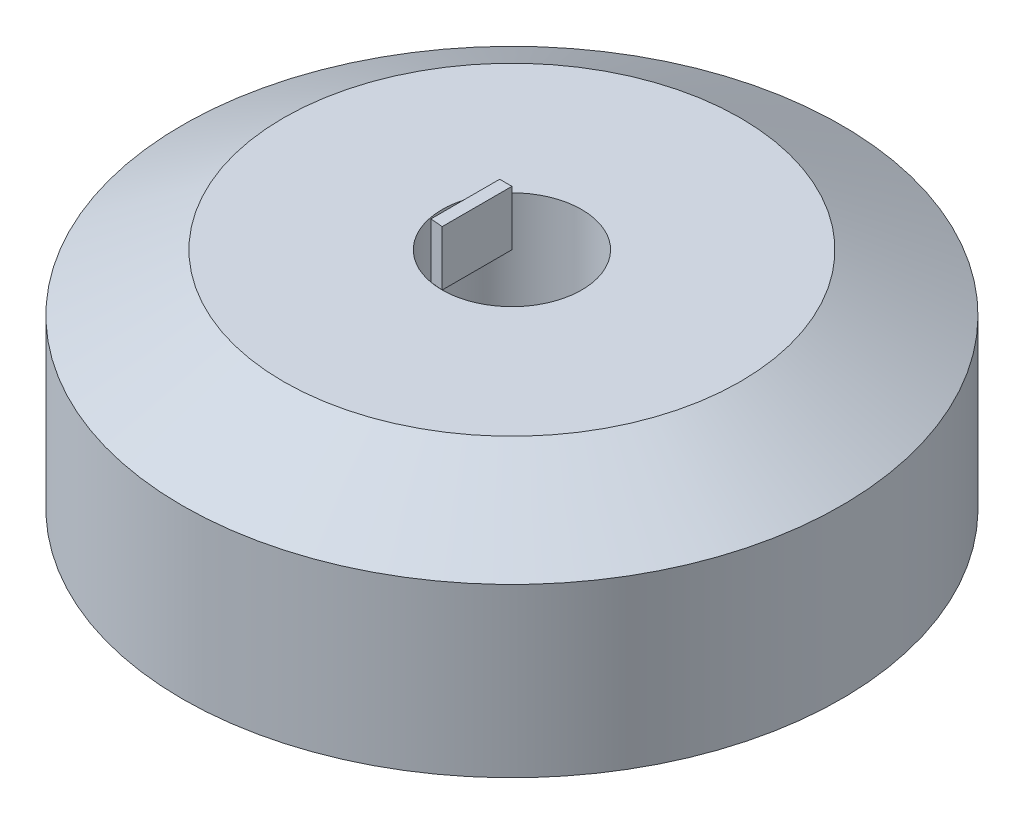
ISO-10303-21;
HEADER;
FILE_DESCRIPTION(('STEP AP214'),'2;1');
FILE_NAME('part.step','',(''),(''),'','','');
FILE_SCHEMA(('AUTOMOTIVE_DESIGN { 1 0 10303 214 1 1 1 1 }'));
ENDSEC;
DATA;
#1=APPLICATION_CONTEXT('core data for automotive mechanical design processes');
#2=APPLICATION_PROTOCOL_DEFINITION('international standard','automotive_design',2000,#1);
#3=PRODUCT_CONTEXT('',#1,'mechanical');
#4=PRODUCT('Part','Part','',(#3));
#5=PRODUCT_RELATED_PRODUCT_CATEGORY('part','',(#4));
#6=PRODUCT_DEFINITION_FORMATION('','',#4);
#7=PRODUCT_DEFINITION_CONTEXT('part definition',#1,'design');
#8=PRODUCT_DEFINITION('design','',#6,#7);
#9=PRODUCT_DEFINITION_SHAPE('','',#8);
#10=(LENGTH_UNIT() NAMED_UNIT(*) SI_UNIT(.MILLI.,.METRE.));
#11=(NAMED_UNIT(*) PLANE_ANGLE_UNIT() SI_UNIT($,.RADIAN.));
#12=(NAMED_UNIT(*) SI_UNIT($,.STERADIAN.) SOLID_ANGLE_UNIT());
#13=UNCERTAINTY_MEASURE_WITH_UNIT(LENGTH_MEASURE(1.E-05),#10,'distance_accuracy_value','');
#14=(GEOMETRIC_REPRESENTATION_CONTEXT(3) GLOBAL_UNCERTAINTY_ASSIGNED_CONTEXT((#13)) GLOBAL_UNIT_ASSIGNED_CONTEXT((#10,
#11,#12)) REPRESENTATION_CONTEXT('',''));
#15=CARTESIAN_POINT('',(0.,0.,0.));
#16=DIRECTION('',(0.,0.,1.));
#17=DIRECTION('',(1.,0.,0.));
#18=AXIS2_PLACEMENT_3D('',#15,#16,#17);
#19=CARTESIAN_POINT('',(0.,7.1181,2.54));
#20=DIRECTION('',(-1.,0.,0.));
#21=DIRECTION('',(0.,0.,1.));
#22=AXIS2_PLACEMENT_3D('',#19,#20,#21);
#23=PLANE('',#22);
#24=DIRECTION('',(0.,0.,-1.));
#25=VECTOR('',#24,1.);
#26=CARTESIAN_POINT('',(0.,5.1181,2.54));
#27=LINE('',#26,#25);
#28=CARTESIAN_POINT('',(0.,5.1181,2.54));
#29=VERTEX_POINT('',#28);
#30=CARTESIAN_POINT('',(0.,5.1181,0.));
#31=VERTEX_POINT('',#30);
#32=EDGE_CURVE('E104',#29,#31,#27,.T.);
#33=ORIENTED_EDGE('',*,*,#32,.T.);
#34=DIRECTION('',(0.,-1.,0.));
#35=VECTOR('',#34,1.);
#36=CARTESIAN_POINT('',(0.,7.1181,0.));
#37=LINE('',#36,#35);
#38=CARTESIAN_POINT('',(0.,7.1181,0.));
#39=VERTEX_POINT('',#38);
#40=EDGE_CURVE('E12',#39,#31,#37,.T.);
#41=ORIENTED_EDGE('',*,*,#40,.F.);
#42=DIRECTION('',(0.,0.,-1.));
#43=VECTOR('',#42,1.);
#44=CARTESIAN_POINT('',(0.,7.1181,2.54));
#45=LINE('',#44,#43);
#46=CARTESIAN_POINT('',(0.,7.1181,2.54));
#47=VERTEX_POINT('',#46);
#48=EDGE_CURVE('E92',#47,#39,#45,.T.);
#49=ORIENTED_EDGE('',*,*,#48,.F.);
#50=DIRECTION('',(0.,-1.,0.));
#51=VECTOR('',#50,1.);
#52=CARTESIAN_POINT('',(0.,7.1181,2.54));
#53=LINE('',#52,#51);
#54=EDGE_CURVE('E100',#47,#29,#53,.T.);
#55=ORIENTED_EDGE('',*,*,#54,.T.);
#56=EDGE_LOOP('',(#33,#41,#49,#55));
#57=FACE_BOUND('',#56,.T.);
#58=ADVANCED_FACE('F41',(#57),#23,.F.);
#59=CARTESIAN_POINT('',(0.,7.1181,0.));
#60=DIRECTION('',(0.,0.,1.));
#61=DIRECTION('',(1.,0.,0.));
#62=AXIS2_PLACEMENT_3D('',#59,#60,#61);
#63=PLANE('',#62);
#64=DIRECTION('',(-1.,0.,0.));
#65=VECTOR('',#64,1.);
#66=CARTESIAN_POINT('',(0.,5.1181,0.));
#67=LINE('',#66,#65);
#68=CARTESIAN_POINT('',(-0.446980104726435,5.1181,0.));
#69=VERTEX_POINT('',#68);
#70=EDGE_CURVE('E96',#31,#69,#67,.T.);
#71=ORIENTED_EDGE('',*,*,#70,.T.);
#72=DIRECTION('',(0.,-1.,0.));
#73=VECTOR('',#72,1.);
#74=CARTESIAN_POINT('',(-0.446980104726435,7.1181,0.));
#75=LINE('',#74,#73);
#76=CARTESIAN_POINT('',(-0.446980104726435,7.1181,0.));
#77=VERTEX_POINT('',#76);
#78=EDGE_CURVE('E49',#77,#69,#75,.T.);
#79=ORIENTED_EDGE('',*,*,#78,.F.);
#80=DIRECTION('',(-1.,0.,0.));
#81=VECTOR('',#80,1.);
#82=CARTESIAN_POINT('',(0.,7.1181,0.));
#83=LINE('',#82,#81);
#84=EDGE_CURVE('E87',#39,#77,#83,.T.);
#85=ORIENTED_EDGE('',*,*,#84,.F.);
#86=ORIENTED_EDGE('',*,*,#40,.T.);
#87=EDGE_LOOP('',(#71,#79,#85,#86));
#88=FACE_BOUND('',#87,.T.);
#89=ADVANCED_FACE('F95',(#88),#63,.F.);
#90=CARTESIAN_POINT('',(-0.446980104726435,7.1181,0.));
#91=DIRECTION('',(1.,0.,0.));
#92=DIRECTION('',(0.,0.,-1.));
#93=AXIS2_PLACEMENT_3D('',#90,#91,#92);
#94=PLANE('',#93);
#95=DIRECTION('',(0.,0.,1.));
#96=VECTOR('',#95,1.);
#97=CARTESIAN_POINT('',(-0.446980104726435,5.1181,0.));
#98=LINE('',#97,#96);
#99=CARTESIAN_POINT('',(-0.446980104726435,5.1181,2.50036173102588));
#100=VERTEX_POINT('',#99);
#101=EDGE_CURVE('E74',#69,#100,#98,.T.);
#102=ORIENTED_EDGE('',*,*,#101,.T.);
#103=DIRECTION('',(0.,-1.,0.));
#104=VECTOR('',#103,1.);
#105=CARTESIAN_POINT('',(-0.446980104726435,7.1181,2.50036173102588));
#106=LINE('',#105,#104);
#107=CARTESIAN_POINT('',(-0.446980104726435,7.1181,2.50036173102588));
#108=VERTEX_POINT('',#107);
#109=EDGE_CURVE('E97',#108,#100,#106,.T.);
#110=ORIENTED_EDGE('',*,*,#109,.F.);
#111=DIRECTION('',(0.,0.,1.));
#112=VECTOR('',#111,1.);
#113=CARTESIAN_POINT('',(-0.446980104726435,7.1181,0.));
#114=LINE('',#113,#112);
#115=EDGE_CURVE('E90',#77,#108,#114,.T.);
#116=ORIENTED_EDGE('',*,*,#115,.F.);
#117=ORIENTED_EDGE('',*,*,#78,.T.);
#118=EDGE_LOOP('',(#102,#110,#116,#117));
#119=FACE_BOUND('',#118,.T.);
#120=ADVANCED_FACE('F98',(#119),#94,.F.);
#121=CARTESIAN_POINT('',(-0.446980104726435,7.1181,2.50036173102588));
#122=DIRECTION('',(0.0883335092316207,0.,-0.996090955258016));
#123=DIRECTION('',(-0.996090955258016,0.,-0.0883335092316207));
#124=AXIS2_PLACEMENT_3D('',#121,#122,#123);
#125=PLANE('',#124);
#126=DIRECTION('',(0.996090955258016,0.,0.0883335092316207));
#127=VECTOR('',#126,1.);
#128=CARTESIAN_POINT('',(-0.446980104726435,5.1181,2.50036173102588));
#129=LINE('',#128,#127);
#130=EDGE_CURVE('E80',#100,#29,#129,.T.);
#131=ORIENTED_EDGE('',*,*,#130,.T.);
#132=ORIENTED_EDGE('',*,*,#54,.F.);
#133=DIRECTION('',(0.996090955258016,0.,0.0883335092316207));
#134=VECTOR('',#133,1.);
#135=CARTESIAN_POINT('',(-0.446980104726435,7.1181,2.50036173102588));
#136=LINE('',#135,#134);
#137=EDGE_CURVE('E57',#108,#47,#136,.T.);
#138=ORIENTED_EDGE('',*,*,#137,.F.);
#139=ORIENTED_EDGE('',*,*,#109,.T.);
#140=EDGE_LOOP('',(#131,#132,#138,#139));
#141=FACE_BOUND('',#140,.T.);
#142=ADVANCED_FACE('F111',(#141),#125,.F.);
#143=CARTESIAN_POINT('',(0.,7.1181,0.));
#144=DIRECTION('',(0.,1.,0.));
#145=DIRECTION('',(0.,0.,1.));
#146=AXIS2_PLACEMENT_3D('',#143,#144,#145);
#147=PLANE('',#146);
#148=ORIENTED_EDGE('',*,*,#48,.T.);
#149=ORIENTED_EDGE('',*,*,#84,.T.);
#150=ORIENTED_EDGE('',*,*,#115,.T.);
#151=ORIENTED_EDGE('',*,*,#137,.T.);
#152=EDGE_LOOP('',(#148,#149,#150,#151));
#153=FACE_BOUND('',#152,.T.);
#154=ADVANCED_FACE('F88',(#153),#147,.T.);
#155=CARTESIAN_POINT('',(0.,5.1181,0.));
#156=DIRECTION('',(0.,1.,0.));
#157=DIRECTION('',(0.,0.,1.));
#158=AXIS2_PLACEMENT_3D('',#155,#156,#157);
#159=PLANE('',#158);
#160=ORIENTED_EDGE('',*,*,#32,.F.);
#161=ORIENTED_EDGE('',*,*,#130,.F.);
#162=ORIENTED_EDGE('',*,*,#101,.F.);
#163=ORIENTED_EDGE('',*,*,#70,.F.);
#164=EDGE_LOOP('',(#160,#161,#162,#163));
#165=FACE_BOUND('',#164,.T.);
#166=ADVANCED_FACE('F114',(#165),#159,.F.);
#167=CLOSED_SHELL('',(#58,#89,#120,#142,#154,#166));
#168=MANIFOLD_SOLID_BREP('B2',#167);
#169=CARTESIAN_POINT('',(0.,5.1181,0.));
#170=DIRECTION('',(0.,-1.,0.));
#171=DIRECTION('',(0.,0.,-1.));
#172=AXIS2_PLACEMENT_3D('',#169,#170,#171);
#173=CYLINDRICAL_SURFACE('',#172,12.0015);
#174=CARTESIAN_POINT('',(0.,-3.048,0.));
#175=DIRECTION('',(0.,1.,0.));
#176=DIRECTION('',(0.,0.,1.));
#177=AXIS2_PLACEMENT_3D('',#174,#175,#176);
#178=CIRCLE('',#177,12.0015);
#179=CARTESIAN_POINT('',(0.,-3.048,12.0015));
#180=VERTEX_POINT('',#179);
#181=EDGE_CURVE('E175',#180,#180,#178,.T.);
#182=ORIENTED_EDGE('',*,*,#181,.T.);
#183=EDGE_LOOP('',(#182));
#184=FACE_BOUND('',#183,.T.);
#185=CARTESIAN_POINT('',(0.,3.048,0.));
#186=DIRECTION('',(0.,1.,0.));
#187=DIRECTION('',(0.,0.,1.));
#188=AXIS2_PLACEMENT_3D('',#185,#186,#187);
#189=CIRCLE('',#188,12.0015);
#190=CARTESIAN_POINT('',(0.,3.048,12.0015));
#191=VERTEX_POINT('',#190);
#192=EDGE_CURVE('E180',#191,#191,#189,.F.);
#193=ORIENTED_EDGE('',*,*,#192,.T.);
#194=EDGE_LOOP('',(#193));
#195=FACE_BOUND('',#194,.T.);
#196=ADVANCED_FACE('F165',(#184,#195),#173,.T.);
#197=CARTESIAN_POINT('',(0.,5.1181,0.));
#198=DIRECTION('',(0.,1.,0.));
#199=DIRECTION('',(0.,0.,1.));
#200=AXIS2_PLACEMENT_3D('',#197,#198,#199);
#201=PLANE('',#200);
#202=CARTESIAN_POINT('',(0.,5.1181,0.));
#203=DIRECTION('',(0.,1.,0.));
#204=DIRECTION('',(0.,0.,1.));
#205=AXIS2_PLACEMENT_3D('',#202,#203,#204);
#206=CIRCLE('',#205,8.31849999999999);
#207=CARTESIAN_POINT('',(0.,5.1181,8.31849999999999));
#208=VERTEX_POINT('',#207);
#209=EDGE_CURVE('E223',#208,#208,#206,.T.);
#210=ORIENTED_EDGE('',*,*,#209,.T.);
#211=EDGE_LOOP('',(#210));
#212=FACE_BOUND('',#211,.T.);
#213=CARTESIAN_POINT('',(0.,5.1181,2.54));
#214=CARTESIAN_POINT('',(-0.0335169392211995,5.1181,2.54001120900573));
#215=CARTESIAN_POINT('',(-0.06703498623236,5.1181,2.53937883147526));
#216=CARTESIAN_POINT('',(-0.13382424067178,5.1181,2.53681541888081));
#217=CARTESIAN_POINT('',(-0.167095742378518,5.1181,2.53489202642674));
#218=CARTESIAN_POINT('',(-0.233392141348672,5.1181,2.52974690765771));
#219=CARTESIAN_POINT('',(-0.266417480716396,5.1181,2.52653089697274));
#220=CARTESIAN_POINT('',(-0.332221292719927,5.1181,2.51880293251821));
#221=CARTESIAN_POINT('',(-0.365000199921852,5.1181,2.51429468148692));
#222=CARTESIAN_POINT('',(-0.430311218550975,5.1181,2.50398416620516));
#223=CARTESIAN_POINT('',(-0.462843590794092,5.1181,2.49818355465415));
#224=CARTESIAN_POINT('',(-0.527661736126569,5.1181,2.48529042558461));
#225=CARTESIAN_POINT('',(-0.559947430027261,5.1181,2.47819750998471));
#226=CARTESIAN_POINT('',(-0.62427257934946,5.1181,2.46272178608599));
#227=CARTESIAN_POINT('',(-0.656311454694636,5.1181,2.4543365674292));
#228=CARTESIAN_POINT('',(-0.720143539420019,5.1181,2.4362783733036));
#229=CARTESIAN_POINT('',(-0.751935518684944,5.1181,2.4266010516515));
#230=CARTESIAN_POINT('',(-0.815274322521748,5.1181,2.40596007805773));
#231=CARTESIAN_POINT('',(-0.846819133707196,5.1181,2.39499025159249));
#232=CARTESIAN_POINT('',(-0.909665023757053,5.1181,2.37176789495205));
#233=CARTESIAN_POINT('',(-0.940963199618276,5.1181,2.35950751516485));
#234=CARTESIAN_POINT('',(-1.00298517151954,5.1181,2.33383505837345));
#235=CARTESIAN_POINT('',(-1.0337102852945,5.1181,2.32042616554309));
#236=CARTESIAN_POINT('',(-1.09443488141687,5.1181,2.29250030244053));
#237=CARTESIAN_POINT('',(-1.12443756388599,5.1181,2.27799029638371));
#238=CARTESIAN_POINT('',(-1.18371840609567,5.1181,2.24786587732229));
#239=CARTESIAN_POINT('',(-1.2129991608628,5.1181,2.23225657252202));
#240=CARTESIAN_POINT('',(-1.27083661654511,5.1181,2.19993494650857));
#241=CARTESIAN_POINT('',(-1.29939513604474,5.1181,2.18322588042439));
#242=CARTESIAN_POINT('',(-1.35578897945898,5.1181,2.14870673199114));
#243=CARTESIAN_POINT('',(-1.38362517678232,5.1181,2.13089807666206));
#244=CARTESIAN_POINT('',(-1.43857534946328,5.1181,2.09418155620238));
#245=CARTESIAN_POINT('',(-1.46568909932003,5.1181,2.07527335359251));
#246=CARTESIAN_POINT('',(-1.51919548459228,5.1181,2.03635947797154));
#247=CARTESIAN_POINT('',(-1.5455866616846,5.1181,2.01635180007261));
#248=CARTESIAN_POINT('',(-1.59764924669674,5.1181,1.97524072342143));
#249=CARTESIAN_POINT('',(-1.62331785492513,5.1181,1.95413378006073));
#250=CARTESIAN_POINT('',(-1.67393632074718,5.1181,1.91082529601752));
#251=CARTESIAN_POINT('',(-1.69888195532675,5.1181,1.88861882131002));
#252=CARTESIAN_POINT('',(-1.74805717570876,5.1181,1.84311408044072));
#253=CARTESIAN_POINT('',(-1.77228107556941,5.1181,1.81980967311382));
#254=CARTESIAN_POINT('',(-1.81975748209032,5.1181,1.77235663463452));
#255=CARTESIAN_POINT('',(-1.84301242470947,5.1181,1.74821044099979));
#256=CARTESIAN_POINT('',(-1.88842787104378,5.1181,1.69917201078149));
#257=CARTESIAN_POINT('',(-1.91059399637574,5.1181,1.67428498366044));
#258=CARTESIAN_POINT('',(-1.95383423707871,5.1181,1.6237678532897));
#259=CARTESIAN_POINT('',(-1.97491270476681,5.1181,1.59814147633176));
#260=CARTESIAN_POINT('',(-2.01597859550183,5.1181,1.54614675154088));
#261=CARTESIAN_POINT('',(-2.03596894438564,5.1181,1.51978071511286));
#262=CARTESIAN_POINT('',(-2.07486015587095,5.1181,1.46630819083358));
#263=CARTESIAN_POINT('',(-2.09376237149378,5.1181,1.43920268713782));
#264=CARTESIAN_POINT('',(-2.13047890726768,5.1181,1.38425252468951));
#265=CARTESIAN_POINT('',(-2.14829288993536,5.1181,1.3564076404422));
#266=CARTESIAN_POINT('',(-2.18283464865778,5.1181,1.29997990005586));
#267=CARTESIAN_POINT('',(-2.19956031016024,5.1181,1.27139574971812));
#268=CARTESIAN_POINT('',(-2.23192733894148,5.1181,1.21349057871036));
#269=CARTESIAN_POINT('',(-2.24756476317973,5.1181,1.18416735464467));
#270=CARTESIAN_POINT('',(-2.27775668839564,5.1181,1.12478468441123));
#271=CARTESIAN_POINT('',(-2.29230539964741,5.1181,1.09472229587632));
#272=CARTESIAN_POINT('',(-2.32032346884031,5.1181,1.03386285503187));
#273=CARTESIAN_POINT('',(-2.33378522353407,5.1181,1.00306230494131));
#274=CARTESIAN_POINT('',(-2.35948821215449,5.1181,0.941052979731045));
#275=CARTESIAN_POINT('',(-2.37173262941135,5.1181,0.909845524382917));
#276=CARTESIAN_POINT('',(-2.39492483594574,5.1181,0.847160183512145));
#277=CARTESIAN_POINT('',(-2.40587981249496,5.1181,0.815684959605685));
#278=CARTESIAN_POINT('',(-2.42649651701778,5.1181,0.752465893086449));
#279=CARTESIAN_POINT('',(-2.43616369199817,5.1181,0.720723827558713));
#280=CARTESIAN_POINT('',(-2.45420610818474,5.1181,0.656971729506255));
#281=CARTESIAN_POINT('',(-2.46258493704811,5.1181,0.62496271277193));
#282=CARTESIAN_POINT('',(-2.47805268220553,5.1181,0.560677519738556));
#283=CARTESIAN_POINT('',(-2.48514322514831,5.1181,0.528401734901784));
#284=CARTESIAN_POINT('',(-2.49803636427979,5.1181,0.463583594573105));
#285=CARTESIAN_POINT('',(-2.5038385623814,5.1181,0.431041159900511));
#286=CARTESIAN_POINT('',(-2.51415702491035,5.1181,0.365690166703891));
#287=CARTESIAN_POINT('',(-2.51867084047769,5.1181,0.332881221700284));
#288=CARTESIAN_POINT('',(-2.52641472630396,5.1181,0.266997493710185));
#289=CARTESIAN_POINT('',(-2.5296403104654,5.1181,0.233922183987807));
#290=CARTESIAN_POINT('',(-2.53480924815157,5.1181,0.167505800801928));
#291=CARTESIAN_POINT('',(-2.53674612667186,5.1181,0.134164224577802));
#292=CARTESIAN_POINT('',(-2.53934154762551,5.1181,0.0672153819345448));
#293=CARTESIAN_POINT('',(-2.53999172703138,5.1181,0.0336077936239234));
#294=CARTESIAN_POINT('',(-2.54000825073206,5.1181,-0.0335174606699641));
#295=CARTESIAN_POINT('',(-2.53937804109521,5.1181,-0.0670351255510078));
#296=CARTESIAN_POINT('',(-2.53681620462271,5.1181,-0.133824102170675));
#297=CARTESIAN_POINT('',(-2.5348922365167,5.1181,-0.167095705346387));
#298=CARTESIAN_POINT('',(-2.52974669848668,5.1181,-0.233392178218804));
#299=CARTESIAN_POINT('',(-2.52653084100175,5.1181,-0.266417490582271));
#300=CARTESIAN_POINT('',(-2.5188029883304,5.1181,-0.332221282882013));
#301=CARTESIAN_POINT('',(-2.51429469643315,5.1181,-0.365000197287295));
#302=CARTESIAN_POINT('',(-2.50398415127794,5.1181,-0.430311221182148));
#303=CARTESIAN_POINT('',(-2.49818355065355,5.1181,-0.462843591499252));
#304=CARTESIAN_POINT('',(-2.48529042958644,5.1181,-0.527661735421157));
#305=CARTESIAN_POINT('',(-2.47819751105807,5.1181,-0.559947429838044));
#306=CARTESIAN_POINT('',(-2.46272178501059,5.1181,-0.624272579539001));
#307=CARTESIAN_POINT('',(-2.45433656714054,5.1181,-0.656311454745502));
#308=CARTESIAN_POINT('',(-2.43627837359326,5.1181,-0.720143539368948));
#309=CARTESIAN_POINT('',(-2.42660105172931,5.1181,-0.751935518671217));
#310=CARTESIAN_POINT('',(-2.40596007797953,5.1181,-0.815274322535523));
#311=CARTESIAN_POINT('',(-2.39499025157148,5.1181,-0.846819133710893));
#312=CARTESIAN_POINT('',(-2.3717678949732,5.1181,-0.909665023753321));
#313=CARTESIAN_POINT('',(-2.35950751517051,5.1181,-0.940963199617277));
#314=CARTESIAN_POINT('',(-2.3338350583678,5.1181,-1.00298517152054));
#315=CARTESIAN_POINT('',(-2.32042616554158,5.1181,-1.03371028529478));
#316=CARTESIAN_POINT('',(-2.29250030244202,5.1181,-1.09443488141663));
#317=CARTESIAN_POINT('',(-2.2779902963841,5.1181,-1.12443756388594));
#318=CARTESIAN_POINT('',(-2.24786587732188,5.1181,-1.18371840609578));
#319=CARTESIAN_POINT('',(-2.23225657252191,5.1181,-1.21299916086286));
#320=CARTESIAN_POINT('',(-2.19993494650867,5.1181,-1.27083661654513));
#321=CARTESIAN_POINT('',(-2.1832258804244,5.1181,-1.29939513604478));
#322=CARTESIAN_POINT('',(-2.1487067319911,5.1181,-1.35578897945904));
#323=CARTESIAN_POINT('',(-2.13089807666204,5.1181,-1.38362517678237));
#324=CARTESIAN_POINT('',(-2.09418155620237,5.1181,-1.43857534946333));
#325=CARTESIAN_POINT('',(-2.0752733535925,5.1181,-1.46568909932008));
#326=CARTESIAN_POINT('',(-2.03635947797153,5.1181,-1.51919548459233));
#327=CARTESIAN_POINT('',(-2.0163518000726,5.1181,-1.54558666168466));
#328=CARTESIAN_POINT('',(-1.97524072342142,5.1181,-1.59764924669677));
#329=CARTESIAN_POINT('',(-1.95413378006071,5.1181,-1.62331785492513));
#330=CARTESIAN_POINT('',(-1.91082529601753,5.1181,-1.67393632074725));
#331=CARTESIAN_POINT('',(-1.88861882131007,5.1181,-1.69888195532691));
#332=CARTESIAN_POINT('',(-1.84311408044066,5.1181,-1.74805717570864));
#333=CARTESIAN_POINT('',(-1.81980967311361,5.1181,-1.77228107556891));
#334=CARTESIAN_POINT('',(-1.77235663463473,5.1181,-1.81975748209083));
#335=CARTESIAN_POINT('',(-1.74821044100056,5.1181,-1.84301242471136));
#336=CARTESIAN_POINT('',(-1.69917201078069,5.1181,-1.88842787104192));
#337=CARTESIAN_POINT('',(-1.6742849836575,5.1181,-1.9105939963688));
#338=CARTESIAN_POINT('',(-1.62376785329254,5.1181,-1.95383423708565));
#339=CARTESIAN_POINT('',(-1.59814147634247,5.1181,-1.97491270479262));
#340=CARTESIAN_POINT('',(-1.54614675153009,5.1181,-2.01597859547614));
#341=CARTESIAN_POINT('',(-1.51978071507281,5.1181,-2.03596894428983));
#342=CARTESIAN_POINT('',(-1.46630819087346,5.1181,-2.07486015596668));
#343=CARTESIAN_POINT('',(-1.43920268728672,5.1181,-2.09376237185075));
#344=CARTESIAN_POINT('',(-1.38425252454044,5.1181,-2.13047890691065));
#345=CARTESIAN_POINT('',(-1.35640763988598,5.1181,-2.14829288860272));
#346=CARTESIAN_POINT('',(-1.29997990061301,5.1181,-2.18283464999299));
#347=CARTESIAN_POINT('',(-1.27139575179942,5.1181,-2.19956031514764));
#348=CARTESIAN_POINT('',(-1.21349057662177,5.1181,-2.23192733393691));
#349=CARTESIAN_POINT('',(-1.18416734683708,5.1181,-2.24756474447122));
#350=CARTESIAN_POINT('',(-1.12478469225768,5.1181,-2.27775670719748));
#351=CARTESIAN_POINT('',(-1.09472232523105,5.1181,-2.29230546998763));
#352=CARTESIAN_POINT('',(-1.03386282548691,5.1181,-2.32032339804441));
#353=CARTESIAN_POINT('',(-1.00306219432721,5.1181,-2.33378495847936));
#354=CARTESIAN_POINT('',(-0.941031468533851,5.1181,-2.35949743887384));
#355=CARTESIAN_POINT('',(-0.90980235129488,5.1181,-2.37175071635191));
#356=CARTESIAN_POINT('',(-0.847078516128703,5.1181,-2.39495871667563));
#357=CARTESIAN_POINT('',(-0.815586528893528,5.1181,-2.4059208127927));
#358=CARTESIAN_POINT('',(-0.752338643632599,5.1181,-2.42654950857586));
#359=CARTESIAN_POINT('',(-0.720584586553895,5.1181,-2.43622175011851));
#360=CARTESIAN_POINT('',(-0.656813253229717,5.1181,-2.45427212763669));
#361=CARTESIAN_POINT('',(-0.624797049338603,5.1181,-2.46265405045756));
#362=CARTESIAN_POINT('',(-0.560502228601902,5.1181,-2.47812578781147));
#363=CARTESIAN_POINT('',(-0.528224051589631,5.1181,-2.48521742974017));
#364=CARTESIAN_POINT('',(-0.46340588448977,5.1181,-2.49811057027154));
#365=CARTESIAN_POINT('',(-0.430865854808346,5.1181,-2.50391186981804));
#366=CARTESIAN_POINT('',(-0.365524437854103,5.1181,-2.51422636381885));
#367=CARTESIAN_POINT('',(-0.332722694803608,5.1181,-2.51873730352245));
#368=CARTESIAN_POINT('',(-0.266858145462286,5.1181,-2.52647318360366));
#369=CARTESIAN_POINT('',(-0.233794834624063,5.1181,-2.52969382365781));
#370=CARTESIAN_POINT('',(-0.167407235422451,5.1181,-2.53485096270861));
#371=CARTESIAN_POINT('',(-0.134082458807119,5.1181,-2.53678116321931));
#372=CARTESIAN_POINT('',(-0.067171998225653,5.1181,-2.53936007156536));
#373=CARTESIAN_POINT('',(-0.0335860002762924,5.1181,-2.54000057182405));
#374=CARTESIAN_POINT('',(0.0335392254157063,5.1181,-2.53999942897232));
#375=CARTESIAN_POINT('',(0.0670784531518675,5.1181,-2.53935957024685));
#376=CARTESIAN_POINT('',(0.133905762330812,5.1181,-2.53678126991194));
#377=CARTESIAN_POINT('',(0.167194143037044,5.1181,-2.53485064457889));
#378=CARTESIAN_POINT('',(0.233519362306802,5.1181,-2.52969334310013));
#379=CARTESIAN_POINT('',(0.266556658035082,5.1181,-2.52647255682495));
#380=CARTESIAN_POINT('',(0.332379604125626,5.1181,-2.51873672204002));
#381=CARTESIAN_POINT('',(0.365165711189848,5.1181,-2.51422556343737));
#382=CARTESIAN_POINT('',(0.43048629895047,5.1181,-2.50391106155325));
#383=CARTESIAN_POINT('',(0.463021071228823,5.1181,-2.49810956542025));
#384=CARTESIAN_POINT('',(0.527839188519619,5.1181,-2.48521644572932));
#385=CARTESIAN_POINT('',(0.560122493941449,5.1181,-2.47812462314045));
#386=CARTESIAN_POINT('',(0.624438028527512,5.1181,-2.4626528774208));
#387=CARTESIAN_POINT('',(0.656469725910279,5.1181,-2.4542707443194));
#388=CARTESIAN_POINT('',(0.720282600333612,5.1181,-2.43622048851341));
#389=CARTESIAN_POINT('',(0.752062603596191,5.1181,-2.42654821802642));
#390=CARTESIAN_POINT('',(0.815372626096086,5.1181,-2.40591919996385));
#391=CARTESIAN_POINT('',(0.846900695483992,5.1181,-2.39495647179642));
#392=CARTESIAN_POINT('',(0.909708141175533,5.1181,-2.3717498617969));
#393=CARTESIAN_POINT('',(0.940984682788293,5.1181,-2.3594983145206));
#394=CARTESIAN_POINT('',(1.00298528082416,5.1181,-2.33383532073388));
#395=CARTESIAN_POINT('',(1.0337103144981,5.1181,-2.32042623563952));
#396=CARTESIAN_POINT('',(1.0944348523847,5.1181,-2.29250023275541));
#397=CARTESIAN_POINT('',(1.12443755612347,5.1181,-2.27799027775143));
#398=CARTESIAN_POINT('',(1.18371841382435,5.1181,-2.24786589587301));
#399=CARTESIAN_POINT('',(1.21299916293092,5.1181,-2.23225657748589));
#400=CARTESIAN_POINT('',(1.27083661448299,5.1181,-2.19993494155872));
#401=CARTESIAN_POINT('',(1.29939513549257,5.1181,-2.18322587909881));
#402=CARTESIAN_POINT('',(1.35578898001061,5.1181,-2.14870673331495));
#403=CARTESIAN_POINT('',(1.38362517693022,5.1181,-2.13089807701681));
#404=CARTESIAN_POINT('',(1.4385753493155,5.1181,-2.09418155584742));
#405=CARTESIAN_POINT('',(1.46568909928046,5.1181,-2.07527335349727));
#406=CARTESIAN_POINT('',(1.51919548463209,5.1181,-2.03635947806687));
#407=CARTESIAN_POINT('',(1.54558666169535,5.1181,-2.01635180009816));
#408=CARTESIAN_POINT('',(1.59764924668611,5.1181,-1.9752407233957));
#409=CARTESIAN_POINT('',(1.62331785492232,5.1181,-1.9541337800538));
#410=CARTESIAN_POINT('',(1.67393632075012,5.1181,-1.91082529602443));
#411=CARTESIAN_POINT('',(1.69888195532757,5.1181,-1.88861882131186));
#412=CARTESIAN_POINT('',(1.748057175708,5.1181,-1.84311408043883));
#413=CARTESIAN_POINT('',(1.77228107556921,5.1181,-1.81980967311331));
#414=CARTESIAN_POINT('',(1.81975748209051,5.1181,-1.77235663463504));
#415=CARTESIAN_POINT('',(1.84301242470949,5.1181,-1.74821044099996));
#416=CARTESIAN_POINT('',(1.88842787104365,5.1181,-1.69917201078142));
#417=CARTESIAN_POINT('',(1.91059399637563,5.1181,-1.67428498366048));
#418=CARTESIAN_POINT('',(1.9538342370786,5.1181,-1.62376785328983));
#419=CARTESIAN_POINT('',(1.97491270476668,5.1181,-1.59814147633187));
#420=CARTESIAN_POINT('',(2.01597859550168,5.1181,-1.54614675154099));
#421=CARTESIAN_POINT('',(2.03596894438548,5.1181,-1.51978071511298));
#422=CARTESIAN_POINT('',(2.07486015587078,5.1181,-1.46630819083371));
#423=CARTESIAN_POINT('',(2.09376237149362,5.1181,-1.43920268713795));
#424=CARTESIAN_POINT('',(2.13047890726751,5.1181,-1.38425252468963));
#425=CARTESIAN_POINT('',(2.1482928899352,5.1181,-1.35640764044232));
#426=CARTESIAN_POINT('',(2.18283464865763,5.1181,-1.29997990005598));
#427=CARTESIAN_POINT('',(2.1995603101601,5.1181,-1.27139574971823));
#428=CARTESIAN_POINT('',(2.23192733894135,5.1181,-1.21349057871046));
#429=CARTESIAN_POINT('',(2.24756476317961,5.1181,-1.18416735464476));
#430=CARTESIAN_POINT('',(2.27775668839555,5.1181,-1.1247846844113));
#431=CARTESIAN_POINT('',(2.29230539964733,5.1181,-1.09472229587638));
#432=CARTESIAN_POINT('',(2.32032346884027,5.1181,-1.0338628550319));
#433=CARTESIAN_POINT('',(2.33378522353405,5.1181,-1.00306230494132));
#434=CARTESIAN_POINT('',(2.3594882121545,5.1181,-0.941052979731076));
#435=CARTESIAN_POINT('',(2.37173262941136,5.1181,-0.909845524382981));
#436=CARTESIAN_POINT('',(2.39492483594574,5.1181,-0.847160183512268));
#437=CARTESIAN_POINT('',(2.40587981249497,5.1181,-0.815684959605834));
#438=CARTESIAN_POINT('',(2.42649651701778,5.1181,-0.752465893086643));
#439=CARTESIAN_POINT('',(2.43616369199817,5.1181,-0.720723827558926));
#440=CARTESIAN_POINT('',(2.45420610818474,5.1181,-0.656971729506497));
#441=CARTESIAN_POINT('',(2.46258493704811,5.1181,-0.624962712772182));
#442=CARTESIAN_POINT('',(2.47805268220553,5.1181,-0.560677519738823));
#443=CARTESIAN_POINT('',(2.48514322514831,5.1181,-0.528401734902055));
#444=CARTESIAN_POINT('',(2.49803636427979,5.1181,-0.463583594573375));
#445=CARTESIAN_POINT('',(2.5038385623814,5.1181,-0.431041159900776));
#446=CARTESIAN_POINT('',(2.51415702491035,5.1181,-0.365690166704141));
#447=CARTESIAN_POINT('',(2.51867084047769,5.1181,-0.332881221700522));
#448=CARTESIAN_POINT('',(2.52641472630396,5.1181,-0.266997493710394));
#449=CARTESIAN_POINT('',(2.5296403104654,5.1181,-0.233922183988));
#450=CARTESIAN_POINT('',(2.53480924815157,5.1181,-0.167505800802078));
#451=CARTESIAN_POINT('',(2.53674612667186,5.1181,-0.134164224577927));
#452=CARTESIAN_POINT('',(2.53934154762551,5.1181,-0.0672153819346114));
#453=CARTESIAN_POINT('',(2.53999172703138,5.1181,-0.0336077936239565));
#454=CARTESIAN_POINT('',(2.54000825073206,5.1181,0.0335174606699746));
#455=CARTESIAN_POINT('',(2.53937804109521,5.1181,0.0670351255510283));
#456=CARTESIAN_POINT('',(2.53681620462271,5.1181,0.133824102170713));
#457=CARTESIAN_POINT('',(2.5348922365167,5.1181,0.167095705346431));
#458=CARTESIAN_POINT('',(2.52974669848668,5.1181,0.233392178218859));
#459=CARTESIAN_POINT('',(2.52653084100175,5.1181,0.26641749058233));
#460=CARTESIAN_POINT('',(2.5188029883304,5.1181,0.33222128288208));
#461=CARTESIAN_POINT('',(2.51429469643315,5.1181,0.365000197287365));
#462=CARTESIAN_POINT('',(2.50398415127794,5.1181,0.430311221182224));
#463=CARTESIAN_POINT('',(2.49818355065355,5.1181,0.46284359149933));
#464=CARTESIAN_POINT('',(2.48529042958644,5.1181,0.527661735421235));
#465=CARTESIAN_POINT('',(2.47819751105807,5.1181,0.559947429838121));
#466=CARTESIAN_POINT('',(2.46272178501059,5.1181,0.624272579539074));
#467=CARTESIAN_POINT('',(2.45433656714054,5.1181,0.656311454745573));
#468=CARTESIAN_POINT('',(2.43627837359326,5.1181,0.72014353936901));
#469=CARTESIAN_POINT('',(2.42660105172931,5.1181,0.751935518671274));
#470=CARTESIAN_POINT('',(2.40596007797953,5.1181,0.815274322535565));
#471=CARTESIAN_POINT('',(2.39499025157148,5.1181,0.846819133710927));
#472=CARTESIAN_POINT('',(2.3717678949732,5.1181,0.909665023753339));
#473=CARTESIAN_POINT('',(2.35950751517051,5.1181,0.940963199617285));
#474=CARTESIAN_POINT('',(2.3338350583678,5.1181,1.00298517152054));
#475=CARTESIAN_POINT('',(2.32042616554157,5.1181,1.03371028529478));
#476=CARTESIAN_POINT('',(2.29250030244201,5.1181,1.09443488141663));
#477=CARTESIAN_POINT('',(2.27799029638409,5.1181,1.12443756388594));
#478=CARTESIAN_POINT('',(2.24786587732186,5.1181,1.18371840609577));
#479=CARTESIAN_POINT('',(2.23225657252188,5.1181,1.21299916086285));
#480=CARTESIAN_POINT('',(2.19993494650864,5.1181,1.27083661654513));
#481=CARTESIAN_POINT('',(2.18322588042438,5.1181,1.29939513604477));
#482=CARTESIAN_POINT('',(2.14870673199107,5.1181,1.35578897945903));
#483=CARTESIAN_POINT('',(2.13089807666201,5.1181,1.38362517678236));
#484=CARTESIAN_POINT('',(2.09418155620234,5.1181,1.43857534946332));
#485=CARTESIAN_POINT('',(2.07527335359247,5.1181,1.46568909932008));
#486=CARTESIAN_POINT('',(2.0363594779715,5.1181,1.51919548459232));
#487=CARTESIAN_POINT('',(2.01635180007257,5.1181,1.54558666168464));
#488=CARTESIAN_POINT('',(1.9752407234214,5.1181,1.59764924669678));
#489=CARTESIAN_POINT('',(1.9541337800607,5.1181,1.62331785492517));
#490=CARTESIAN_POINT('',(1.9108252960175,5.1181,1.6739363207472));
#491=CARTESIAN_POINT('',(1.88861882131,5.1181,1.69888195532677));
#492=CARTESIAN_POINT('',(1.84311408044071,5.1181,1.74805717570877));
#493=CARTESIAN_POINT('',(1.81980967311382,5.1181,1.77228107556942));
#494=CARTESIAN_POINT('',(1.77235663463454,5.1181,1.81975748209031));
#495=CARTESIAN_POINT('',(1.74821044099983,5.1181,1.84301242470944));
#496=CARTESIAN_POINT('',(1.69917201078156,5.1181,1.88842787104372));
#497=CARTESIAN_POINT('',(1.67428498366052,5.1181,1.91059399637566));
#498=CARTESIAN_POINT('',(1.6237678532898,5.1181,1.95383423707861));
#499=CARTESIAN_POINT('',(1.59814147633187,5.1181,1.9749127047667));
#500=CARTESIAN_POINT('',(1.546146751541,5.1181,2.01597859550171));
#501=CARTESIAN_POINT('',(1.51978071511299,5.1181,2.03596894438551));
#502=CARTESIAN_POINT('',(1.46630819083371,5.1181,2.07486015587081));
#503=CARTESIAN_POINT('',(1.43920268713796,5.1181,2.09376237149365));
#504=CARTESIAN_POINT('',(1.38425252468964,5.1181,2.13047890726754));
#505=CARTESIAN_POINT('',(1.35640764044233,5.1181,2.14829288993522));
#506=CARTESIAN_POINT('',(1.29997990005599,5.1181,2.18283464865766));
#507=CARTESIAN_POINT('',(1.27139574971826,5.1181,2.19956031016014));
#508=CARTESIAN_POINT('',(1.21349057871044,5.1181,2.23192733894136));
#509=CARTESIAN_POINT('',(1.18416735464469,5.1181,2.24756476317958));
#510=CARTESIAN_POINT('',(1.12478468441139,5.1181,2.27775668839562));
#511=CARTESIAN_POINT('',(1.09472229587668,5.1181,2.29230539964754));
#512=CARTESIAN_POINT('',(1.0338628550316,5.1181,2.32032346884009));
#513=CARTESIAN_POINT('',(1.0030623049402,5.1181,2.33378522353333));
#514=CARTESIAN_POINT('',(0.94105297973219,5.1181,2.35948821215521));
#515=CARTESIAN_POINT('',(0.90984552438715,5.1181,2.37173262941403));
#516=CARTESIAN_POINT('',(0.84716018350807,5.1181,2.39492483594308));
#517=CARTESIAN_POINT('',(0.815684959590298,5.1181,2.40587981248506));
#518=CARTESIAN_POINT('',(0.752465893102013,5.1181,2.42649651702765));
#519=CARTESIAN_POINT('',(0.720723827616305,5.1181,2.4361636920349));
#520=CARTESIAN_POINT('',(0.656971729449151,5.1181,2.45420610814811));
#521=CARTESIAN_POINT('',(0.624962712558666,5.1181,2.4625849369116));
#522=CARTESIAN_POINT('',(0.56067751995192,5.1181,2.47805268234187));
#523=CARTESIAN_POINT('',(0.528401735696997,5.1181,2.48514322565678));
#524=CARTESIAN_POINT('',(0.463583593778033,5.1181,2.49803636377116));
#525=CARTESIAN_POINT('',(0.431041156932455,5.1181,2.50383856048302));
#526=CARTESIAN_POINT('',(0.365690169677919,5.1181,2.51415702681232));
#527=CARTESIAN_POINT('',(0.332881232808812,5.1181,2.5186708475822));
#528=CARTESIAN_POINT('',(0.266997482563622,5.1181,2.52641471917492));
#529=CARTESIAN_POINT('',(0.233922142318547,5.1181,2.52964028381514));
#530=CARTESIAN_POINT('',(0.167505842679248,5.1181,2.53480927493474));
#531=CARTESIAN_POINT('',(0.134164381246274,5.1181,2.53674622687137));
#532=CARTESIAN_POINT('',(0.067215224251231,5.1181,2.53934144677685));
#533=CARTESIAN_POINT('',(0.0336072032689637,5.1181,2.53999134946138));
#534=CARTESIAN_POINT('',(0.,5.1181,2.54));
#535=B_SPLINE_CURVE_WITH_KNOTS('',3,(#213,#214,#215,#216,#217,#218,#219,#220,#221,#222,#223,
#224,#225,#226,#227,#228,#229,#230,#231,#232,#233,#234,#235,#236,#237,#238,#239,#240,#241,#242,
#243,#244,#245,#246,#247,#248,#249,#250,#251,#252,#253,#254,#255,#256,#257,#258,#259,#260,#261,
#262,#263,#264,#265,#266,#267,#268,#269,#270,#271,#272,#273,#274,#275,#276,#277,#278,#279,#280,
#281,#282,#283,#284,#285,#286,#287,#288,#289,#290,#291,#292,#293,#294,#295,#296,#297,#298,#299,
#300,#301,#302,#303,#304,#305,#306,#307,#308,#309,#310,#311,#312,#313,#314,#315,#316,#317,#318,
#319,#320,#321,#322,#323,#324,#325,#326,#327,#328,#329,#330,#331,#332,#333,#334,#335,#336,#337,
#338,#339,#340,#341,#342,#343,#344,#345,#346,#347,#348,#349,#350,#351,#352,#353,#354,#355,#356,
#357,#358,#359,#360,#361,#362,#363,#364,#365,#366,#367,#368,#369,#370,#371,#372,#373,#374,#375,
#376,#377,#378,#379,#380,#381,#382,#383,#384,#385,#386,#387,#388,#389,#390,#391,#392,#393,#394,
#395,#396,#397,#398,#399,#400,#401,#402,#403,#404,#405,#406,#407,#408,#409,#410,#411,#412,#413,
#414,#415,#416,#417,#418,#419,#420,#421,#422,#423,#424,#425,#426,#427,#428,#429,#430,#431,#432,
#433,#434,#435,#436,#437,#438,#439,#440,#441,#442,#443,#444,#445,#446,#447,#448,#449,#450,#451,
#452,#453,#454,#455,#456,#457,#458,#459,#460,#461,#462,#463,#464,#465,#466,#467,#468,#469,#470,
#471,#472,#473,#474,#475,#476,#477,#478,#479,#480,#481,#482,#483,#484,#485,#486,#487,#488,#489,
#490,#491,#492,#493,#494,#495,#496,#497,#498,#499,#500,#501,#502,#503,#504,#505,#506,#507,#508,
#509,#510,#511,#512,#513,#514,#515,#516,#517,#518,#519,#520,#521,#522,#523,#524,#525,#526,#527,
#528,#529,#530,#531,#532,#533,#534),.UNSPECIFIED.,.F.,.F.,(4,2,2,2,2,2,2,2,2,2,2,2,2,2,2,2,2,2,
2,2,2,2,2,2,2,2,2,2,2,2,2,2,2,2,2,2,2,2,2,2,2,2,2,2,2,2,2,2,2,2,2,2,2,2,2,2,2,2,2,2,2,2,2,2,2,2,
2,2,2,2,2,2,2,2,2,2,2,2,2,2,2,2,2,2,2,2,2,2,2,2,2,2,2,2,2,2,2,2,2,2,2,2,2,2,2,2,2,2,2,2,2,2,2,2,
2,2,2,2,2,2,2,2,2,2,2,2,2,2,2,2,2,2,2,2,2,2,2,2,2,2,2,2,2,2,2,2,2,2,2,2,2,2,2,2,2,2,2,2,2,2,4),
(0.,0.100545965059406,0.200501902332436,0.300020638448224,0.399257019960189,0.498367216855584,
0.597507995434589,0.696835977199089,0.796506901149448,0.896674906702011,0.997491853329003,
1.09803781838842,1.19799375566146,1.29751249177725,1.39674887328922,1.49585907018462,
1.59499984876362,1.69432783052811,1.79399875447847,1.89416676003102,1.99498370665801,
2.09552967171747,2.19548560899055,2.29500434510637,2.39424072661835,2.49335092351375,
2.59249170209275,2.69181968385723,2.79149060780756,2.89165861336008,2.99247555998701,
3.09302152504647,3.19297746231953,3.29249619843534,3.39173257994732,3.49084277684273,
3.58998355542172,3.68931153718621,3.78898246113654,3.88915046668907,3.98996741331601,
4.09051337837541,4.19046931564844,4.28998805176422,4.38922443327618,4.48833463017158,
4.58747540875058,4.68680339051509,4.78647431446545,4.88664232001802,4.98745926664501,
5.08800523170445,5.1879611689775,5.2874799050933,5.38671628660527,5.48582648350067,
5.58496726207967,5.68429524384417,5.78396616779451,5.88413417334705,5.98495111997402,
6.08549708503351,6.1854530223066,6.28497175842243,6.38420813993443,6.48331833682983,
6.58245911540882,6.6817870971733,6.78145802112361,6.88162602667611,6.98244297330303,
7.08305915016537,7.18306961447727,7.28262717939464,7.38188674985304,7.48100462794677,
7.58013778598651,7.67944312382376,7.77907672788344,7.87919314925267,7.97994471714396,
8.08055596941257,8.18056341982858,8.28011942455568,8.3793784185995,8.4784962252884,
8.57762933373308,8.67693416070462,8.77656631421264,8.87667987597281,8.97742671893489,
9.07797268399434,9.1779286212674,9.27744735738321,9.37668373889519,9.47579393579059,
9.57493471436959,9.67426269613408,9.77393362008441,9.87410162563694,9.97491857226389,
10.0754645373233,10.1754204745963,10.2749392107121,10.374175592224,10.4732857891194,
10.5724265676984,10.6717545494629,10.7714254734133,10.8715934789659,10.9724104255929,
11.0729563906522,11.1729123279252,11.272431064041,11.3716674455529,11.4707776424483,
11.5699184210273,11.6692464027919,11.7689173267422,11.8690853322948,11.9699022789219,
12.0704482439813,12.1704041812544,12.2699229173702,12.3691592988821,12.4682694957775,
12.5674102743565,12.666738256121,12.7664091800714,12.8665771856239,12.9673941322509,
13.0679400973103,13.1678960345834,13.2674147706992,13.3666511522112,13.4657613491066,
13.5649021276856,13.6642301094501,13.7639010334004,13.8640690389529,13.9648859855799,
14.0654319506393,14.1653878879123,14.2649066240281,14.3641430055401,14.4632532024354,
14.5623939810145,14.661721962779,14.7613928867293,14.8615608922819,14.9623778389089,
15.0629238039683,15.1628797412413,15.2623984773571,15.361634858869,15.4607450557644,
15.5598858343434,15.6592138161079,15.7588847400583,15.8590527456109,15.9598696922379),.UNSPECIFIED.);
#536=CARTESIAN_POINT('',(0.,5.1181,2.54));
#537=VERTEX_POINT('',#536);
#538=EDGE_CURVE('E188',#537,#537,#535,.T.);
#539=ORIENTED_EDGE('',*,*,#538,.T.);
#540=EDGE_LOOP('',(#539));
#541=FACE_BOUND('',#540,.T.);
#542=ADVANCED_FACE('F192',(#212,#541),#201,.T.);
#543=CARTESIAN_POINT('',(0.,-5.1181,0.));
#544=DIRECTION('',(0.,1.,0.));
#545=DIRECTION('',(0.,0.,1.));
#546=AXIS2_PLACEMENT_3D('',#543,#544,#545);
#547=PLANE('',#546);
#548=CARTESIAN_POINT('',(0.,-5.1181,0.));
#549=DIRECTION('',(0.,1.,0.));
#550=DIRECTION('',(0.,0.,1.));
#551=AXIS2_PLACEMENT_3D('',#548,#549,#550);
#552=CIRCLE('',#551,8.31849999999998);
#553=CARTESIAN_POINT('',(0.,-5.1181,8.31849999999998));
#554=VERTEX_POINT('',#553);
#555=EDGE_CURVE('E40',#554,#554,#552,.F.);
#556=ORIENTED_EDGE('',*,*,#555,.T.);
#557=EDGE_LOOP('',(#556));
#558=FACE_BOUND('',#557,.T.);
#559=CARTESIAN_POINT('',(0.,-5.1181,0.));
#560=DIRECTION('',(0.,1.,0.));
#561=DIRECTION('',(0.,0.,1.));
#562=AXIS2_PLACEMENT_3D('',#559,#560,#561);
#563=CIRCLE('',#562,2.54);
#564=CARTESIAN_POINT('',(0.,-5.1181,2.54));
#565=VERTEX_POINT('',#564);
#566=EDGE_CURVE('E224',#565,#565,#563,.T.);
#567=ORIENTED_EDGE('',*,*,#566,.T.);
#568=EDGE_LOOP('',(#567));
#569=FACE_BOUND('',#568,.T.);
#570=ADVANCED_FACE('F201',(#558,#569),#547,.F.);
#571=CARTESIAN_POINT('',(0.,5.1181,0.));
#572=DIRECTION('',(0.,-1.,0.));
#573=DIRECTION('',(0.,0.,-1.));
#574=AXIS2_PLACEMENT_3D('',#571,#572,#573);
#575=CYLINDRICAL_SURFACE('',#574,2.54);
#576=ORIENTED_EDGE('',*,*,#538,.F.);
#577=EDGE_LOOP('',(#576));
#578=FACE_BOUND('',#577,.T.);
#579=ORIENTED_EDGE('',*,*,#566,.F.);
#580=EDGE_LOOP('',(#579));
#581=FACE_BOUND('',#580,.T.);
#582=ADVANCED_FACE('F203',(#578,#581),#575,.F.);
#583=CARTESIAN_POINT('',(0.,5.1181,0.));
#584=DIRECTION('',(0.,-1.,0.));
#585=DIRECTION('',(0.,0.,-1.));
#586=AXIS2_PLACEMENT_3D('',#583,#584,#585);
#587=CONICAL_SURFACE('',#586,8.31849999999999,1.05873435951322);
#588=ORIENTED_EDGE('',*,*,#192,.F.);
#589=EDGE_LOOP('',(#588));
#590=FACE_BOUND('',#589,.T.);
#591=ORIENTED_EDGE('',*,*,#209,.F.);
#592=EDGE_LOOP('',(#591));
#593=FACE_BOUND('',#592,.T.);
#594=ADVANCED_FACE('F209',(#590,#593),#587,.T.);
#595=CARTESIAN_POINT('',(0.,-3.048,0.));
#596=DIRECTION('',(0.,1.,0.));
#597=DIRECTION('',(0.,0.,1.));
#598=AXIS2_PLACEMENT_3D('',#595,#596,#597);
#599=CONICAL_SURFACE('',#598,12.0015,1.05873435951323);
#600=ORIENTED_EDGE('',*,*,#555,.F.);
#601=EDGE_LOOP('',(#600));
#602=FACE_BOUND('',#601,.T.);
#603=ORIENTED_EDGE('',*,*,#181,.F.);
#604=EDGE_LOOP('',(#603));
#605=FACE_BOUND('',#604,.T.);
#606=ADVANCED_FACE('F167',(#602,#605),#599,.T.);
#607=CLOSED_SHELL('',(#196,#542,#570,#582,#594,#606));
#608=MANIFOLD_SOLID_BREP('B6',#607);
#609=ADVANCED_BREP_SHAPE_REPRESENTATION('',(#18,#168,#608),#14);
#610=SHAPE_DEFINITION_REPRESENTATION(#9,#609);
ENDSEC;
END-ISO-10303-21;
